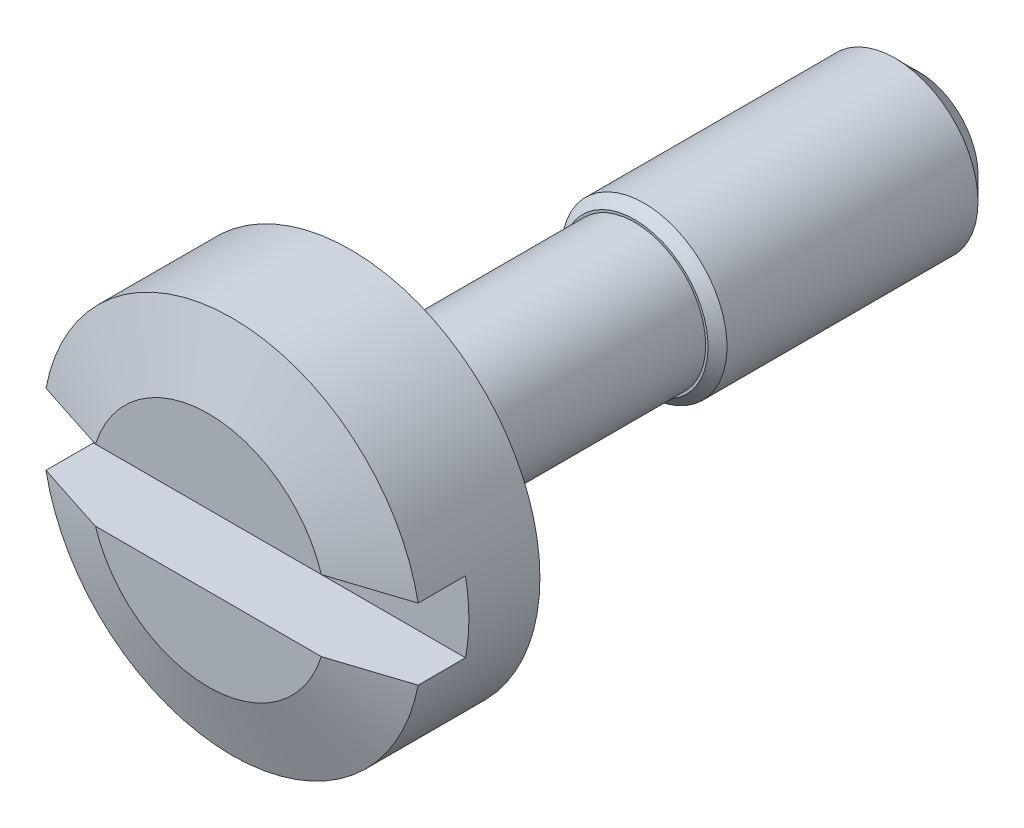
ISO-10303-21;
HEADER;
FILE_DESCRIPTION(('STEP AP214'),'2;1');
FILE_NAME('part.step','',(''),(''),'','','');
FILE_SCHEMA(('AUTOMOTIVE_DESIGN { 1 0 10303 214 1 1 1 1 }'));
ENDSEC;
DATA;
#1=APPLICATION_CONTEXT('core data for automotive mechanical design processes');
#2=APPLICATION_PROTOCOL_DEFINITION('international standard','automotive_design',2000,#1);
#3=PRODUCT_CONTEXT('',#1,'mechanical');
#4=PRODUCT('Part','Part','',(#3));
#5=PRODUCT_RELATED_PRODUCT_CATEGORY('part','',(#4));
#6=PRODUCT_DEFINITION_FORMATION('','',#4);
#7=PRODUCT_DEFINITION_CONTEXT('part definition',#1,'design');
#8=PRODUCT_DEFINITION('design','',#6,#7);
#9=PRODUCT_DEFINITION_SHAPE('','',#8);
#10=(LENGTH_UNIT() NAMED_UNIT(*) SI_UNIT(.MILLI.,.METRE.));
#11=(NAMED_UNIT(*) PLANE_ANGLE_UNIT() SI_UNIT($,.RADIAN.));
#12=(NAMED_UNIT(*) SI_UNIT($,.STERADIAN.) SOLID_ANGLE_UNIT());
#13=UNCERTAINTY_MEASURE_WITH_UNIT(LENGTH_MEASURE(1.E-05),#10,'distance_accuracy_value','');
#14=(GEOMETRIC_REPRESENTATION_CONTEXT(3) GLOBAL_UNCERTAINTY_ASSIGNED_CONTEXT((#13)) GLOBAL_UNIT_ASSIGNED_CONTEXT((#10,
#11,#12)) REPRESENTATION_CONTEXT('',''));
#15=CARTESIAN_POINT('',(0.,0.,0.));
#16=DIRECTION('',(0.,0.,1.));
#17=DIRECTION('',(1.,0.,0.));
#18=AXIS2_PLACEMENT_3D('',#15,#16,#17);
#19=CARTESIAN_POINT('',(0.,0.,-12.));
#20=DIRECTION('',(0.,0.,-1.));
#21=DIRECTION('',(-1.,0.,0.));
#22=AXIS2_PLACEMENT_3D('',#19,#20,#21);
#23=PLANE('',#22);
#24=CARTESIAN_POINT('',(0.,0.,-12.));
#25=DIRECTION('',(0.,0.,-1.));
#26=DIRECTION('',(-1.,0.,0.));
#27=AXIS2_PLACEMENT_3D('',#24,#25,#26);
#28=CIRCLE('',#27,1.24999406649664);
#29=CARTESIAN_POINT('',(-1.24999406649664,0.,-12.));
#30=VERTEX_POINT('',#29);
#31=EDGE_CURVE('E19',#30,#30,#28,.F.);
#32=ORIENTED_EDGE('',*,*,#31,.F.);
#33=EDGE_LOOP('',(#32));
#34=FACE_BOUND('',#33,.T.);
#35=ADVANCED_FACE('F16',(#34),#23,.T.);
#36=CARTESIAN_POINT('',(0.,0.,-11.4999953298707));
#37=DIRECTION('',(0.,0.,1.));
#38=DIRECTION('',(1.,0.,0.));
#39=AXIS2_PLACEMENT_3D('',#36,#37,#38);
#40=CONICAL_SURFACE('',#39,1.74999636323037,0.785395790018378);
#41=CARTESIAN_POINT('',(0.,0.,-11.4999916930838));
#42=DIRECTION('',(0.,0.,1.));
#43=DIRECTION('',(1.,0.,0.));
#44=AXIS2_PLACEMENT_3D('',#41,#42,#43);
#45=CIRCLE('',#44,1.75);
#46=CARTESIAN_POINT('',(1.75,0.,-11.4999916930838));
#47=VERTEX_POINT('',#46);
#48=EDGE_CURVE('E213',#47,#47,#45,.T.);
#49=ORIENTED_EDGE('',*,*,#48,.F.);
#50=EDGE_LOOP('',(#49));
#51=FACE_BOUND('',#50,.T.);
#52=ORIENTED_EDGE('',*,*,#31,.T.);
#53=EDGE_LOOP('',(#52));
#54=FACE_BOUND('',#53,.T.);
#55=ADVANCED_FACE('F164',(#51,#54),#40,.T.);
#56=CARTESIAN_POINT('',(0.,0.,1.5));
#57=DIRECTION('',(0.,0.,1.));
#58=DIRECTION('',(1.,0.,0.));
#59=AXIS2_PLACEMENT_3D('',#56,#57,#58);
#60=PLANE('',#59);
#61=DIRECTION('',(1.,0.,0.));
#62=VECTOR('',#61,1.);
#63=CARTESIAN_POINT('',(-3.929058411375,-0.75,1.5));
#64=LINE('',#63,#62);
#65=CARTESIAN_POINT('',(-3.92905841137521,-0.75,1.5));
#66=VERTEX_POINT('',#65);
#67=CARTESIAN_POINT('',(3.92905841137521,-0.75,1.5));
#68=VERTEX_POINT('',#67);
#69=EDGE_CURVE('E93',#66,#68,#64,.T.);
#70=ORIENTED_EDGE('',*,*,#69,.T.);
#71=CARTESIAN_POINT('',(0.,0.,1.5));
#72=DIRECTION('',(0.,0.,1.));
#73=DIRECTION('',(1.,0.,0.));
#74=AXIS2_PLACEMENT_3D('',#71,#72,#73);
#75=CIRCLE('',#74,4.);
#76=CARTESIAN_POINT('',(3.92905841137521,0.75,1.5));
#77=VERTEX_POINT('',#76);
#78=EDGE_CURVE('E76',#68,#77,#75,.T.);
#79=ORIENTED_EDGE('',*,*,#78,.T.);
#80=DIRECTION('',(1.,0.,0.));
#81=VECTOR('',#80,1.);
#82=CARTESIAN_POINT('',(3.929058411375,0.75,1.5));
#83=LINE('',#82,#81);
#84=CARTESIAN_POINT('',(-3.92905841137521,0.75,1.5));
#85=VERTEX_POINT('',#84);
#86=EDGE_CURVE('E80',#77,#85,#83,.F.);
#87=ORIENTED_EDGE('',*,*,#86,.T.);
#88=CARTESIAN_POINT('',(0.,0.,1.5));
#89=DIRECTION('',(0.,0.,1.));
#90=DIRECTION('',(1.,0.,0.));
#91=AXIS2_PLACEMENT_3D('',#88,#89,#90);
#92=CIRCLE('',#91,4.);
#93=EDGE_CURVE('E68',#85,#66,#92,.T.);
#94=ORIENTED_EDGE('',*,*,#93,.T.);
#95=EDGE_LOOP('',(#70,#79,#87,#94));
#96=FACE_BOUND('',#95,.T.);
#97=ADVANCED_FACE('F87',(#96),#60,.T.);
#98=CARTESIAN_POINT('',(0.,0.,-6.));
#99=DIRECTION('',(0.,0.,-1.));
#100=DIRECTION('',(-1.,0.,0.));
#101=AXIS2_PLACEMENT_3D('',#98,#99,#100);
#102=CYLINDRICAL_SURFACE('',#101,1.75);
#103=ORIENTED_EDGE('',*,*,#48,.T.);
#104=EDGE_LOOP('',(#103));
#105=FACE_BOUND('',#104,.T.);
#106=CARTESIAN_POINT('',(0.,0.,-6.20001215710185));
#107=DIRECTION('',(0.,0.,-1.));
#108=DIRECTION('',(-1.,0.,0.));
#109=AXIS2_PLACEMENT_3D('',#106,#107,#108);
#110=CIRCLE('',#109,1.75);
#111=CARTESIAN_POINT('',(-1.75,0.,-6.20001215710185));
#112=VERTEX_POINT('',#111);
#113=EDGE_CURVE('E206',#112,#112,#110,.F.);
#114=ORIENTED_EDGE('',*,*,#113,.F.);
#115=EDGE_LOOP('',(#114));
#116=FACE_BOUND('',#115,.T.);
#117=ADVANCED_FACE('F158',(#105,#116),#102,.T.);
#118=CARTESIAN_POINT('',(0.,0.,3.));
#119=DIRECTION('',(0.,0.,1.));
#120=DIRECTION('',(1.,0.,0.));
#121=AXIS2_PLACEMENT_3D('',#118,#119,#120);
#122=PLANE('',#121);
#123=CARTESIAN_POINT('',(0.,0.,2.9999999999859));
#124=DIRECTION('',(0.,0.,-1.));
#125=DIRECTION('',(-1.,0.,0.));
#126=AXIS2_PLACEMENT_3D('',#123,#124,#125);
#127=CIRCLE('',#126,2.50000011760676);
#128=CARTESIAN_POINT('',(-2.38484812680558,0.75,2.99999999999295));
#129=VERTEX_POINT('',#128);
#130=CARTESIAN_POINT('',(2.38484812680558,0.75,2.99999999999295));
#131=VERTEX_POINT('',#130);
#132=EDGE_CURVE('E208',#129,#131,#127,.T.);
#133=ORIENTED_EDGE('',*,*,#132,.F.);
#134=DIRECTION('',(1.,0.,0.));
#135=VECTOR('',#134,1.);
#136=CARTESIAN_POINT('',(3.929058411375,0.75,3.));
#137=LINE('',#136,#135);
#138=EDGE_CURVE('E90',#129,#131,#137,.T.);
#139=ORIENTED_EDGE('',*,*,#138,.T.);
#140=EDGE_LOOP('',(#133,#139));
#141=FACE_BOUND('',#140,.T.);
#142=ADVANCED_FACE('F154',(#141),#122,.T.);
#143=CARTESIAN_POINT('',(3.929058411375,0.75,3.));
#144=DIRECTION('',(0.,1.,0.));
#145=DIRECTION('',(0.,0.,1.));
#146=AXIS2_PLACEMENT_3D('',#143,#144,#145);
#147=PLANE('',#146);
#148=DIRECTION('',(0.,0.,1.));
#149=VECTOR('',#148,1.);
#150=CARTESIAN_POINT('',(-3.929058411375,0.75,3.));
#151=LINE('',#150,#149);
#152=CARTESIAN_POINT('',(-3.929058411375,0.75,2.50000006268605));
#153=VERTEX_POINT('',#152);
#154=EDGE_CURVE('E73',#85,#153,#151,.T.);
#155=ORIENTED_EDGE('',*,*,#154,.F.);
#156=ORIENTED_EDGE('',*,*,#86,.F.);
#157=DIRECTION('',(0.,0.,1.));
#158=VECTOR('',#157,1.);
#159=CARTESIAN_POINT('',(3.929058411375,0.75,3.));
#160=LINE('',#159,#158);
#161=CARTESIAN_POINT('',(3.929058411375,0.75,2.50000006268605));
#162=VERTEX_POINT('',#161);
#163=EDGE_CURVE('E88',#162,#77,#160,.F.);
#164=ORIENTED_EDGE('',*,*,#163,.F.);
#165=CARTESIAN_POINT('',(2.38484812679657,0.75,2.99999999999582));
#166=CARTESIAN_POINT('',(2.51374687511697,0.75,2.95899823738204));
#167=CARTESIAN_POINT('',(2.64256768103771,0.75,2.91775286142067));
#168=CARTESIAN_POINT('',(2.90009194379183,0.75,2.83489904226949));
#169=CARTESIAN_POINT('',(3.02879540112082,0.75,2.79329060062098));
#170=CARTESIAN_POINT('',(3.28612426157192,0.75,2.70983456783993));
#171=CARTESIAN_POINT('',(3.41474966489581,0.75,2.66798697732857));
#172=CARTESIAN_POINT('',(3.6719426732032,0.75,2.58411270811083));
#173=CARTESIAN_POINT('',(3.80051027794505,0.75,2.54208602866326));
#174=CARTESIAN_POINT('',(3.9290584113746,0.75,2.50000006267423));
#175=B_SPLINE_CURVE_WITH_KNOTS('',3,(#165,#166,#167,#168,#169,#170,#171,#172,#173,#174),
.UNSPECIFIED.,.F.,.F.,(4,2,2,2,4),(0.,0.405787624750844,0.81157352768695,1.21735837711979,
1.62314490758791),.UNSPECIFIED.);
#176=EDGE_CURVE('E139',#131,#162,#175,.T.);
#177=ORIENTED_EDGE('',*,*,#176,.F.);
#178=ORIENTED_EDGE('',*,*,#138,.F.);
#179=CARTESIAN_POINT('',(-3.9290584113746,0.75,2.50000006267423));
#180=CARTESIAN_POINT('',(-3.80051027794505,0.75,2.54208602866326));
#181=CARTESIAN_POINT('',(-3.6719426732032,0.75,2.58411270811083));
#182=CARTESIAN_POINT('',(-3.41474966489581,0.75,2.66798697732857));
#183=CARTESIAN_POINT('',(-3.28612426157192,0.75,2.70983456783994));
#184=CARTESIAN_POINT('',(-3.02879540112082,0.75,2.79329060062098));
#185=CARTESIAN_POINT('',(-2.90009194379183,0.75,2.83489904226949));
#186=CARTESIAN_POINT('',(-2.64256768103771,0.75,2.91775286142066));
#187=CARTESIAN_POINT('',(-2.51374687511697,0.75,2.95899823738204));
#188=CARTESIAN_POINT('',(-2.38484812679657,0.75,2.99999999999582));
#189=B_SPLINE_CURVE_WITH_KNOTS('',3,(#179,#180,#181,#182,#183,#184,#185,#186,#187,#188),
.UNSPECIFIED.,.F.,.F.,(4,2,2,2,4),(0.,0.405786530468124,0.811571379900961,1.21735728283707,
1.62314490758791),.UNSPECIFIED.);
#190=EDGE_CURVE('E83',#153,#129,#189,.T.);
#191=ORIENTED_EDGE('',*,*,#190,.F.);
#192=EDGE_LOOP('',(#155,#156,#164,#177,#178,#191));
#193=FACE_BOUND('',#192,.T.);
#194=ADVANCED_FACE('F79',(#193),#147,.F.);
#195=CARTESIAN_POINT('',(0.,0.,3.));
#196=DIRECTION('',(0.,0.,1.));
#197=DIRECTION('',(1.,0.,0.));
#198=AXIS2_PLACEMENT_3D('',#195,#196,#197);
#199=PLANE('',#198);
#200=CARTESIAN_POINT('',(0.,0.,2.9999999999859));
#201=DIRECTION('',(0.,0.,-1.));
#202=DIRECTION('',(-1.,0.,0.));
#203=AXIS2_PLACEMENT_3D('',#200,#201,#202);
#204=CIRCLE('',#203,2.50000011760676);
#205=CARTESIAN_POINT('',(2.38484812680558,-0.75,2.99999999999295));
#206=VERTEX_POINT('',#205);
#207=CARTESIAN_POINT('',(-2.38484812680558,-0.75,2.99999999999295));
#208=VERTEX_POINT('',#207);
#209=EDGE_CURVE('E149',#206,#208,#204,.T.);
#210=ORIENTED_EDGE('',*,*,#209,.F.);
#211=DIRECTION('',(1.,0.,0.));
#212=VECTOR('',#211,1.);
#213=CARTESIAN_POINT('',(-3.929058411375,-0.75,3.));
#214=LINE('',#213,#212);
#215=EDGE_CURVE('E85',#206,#208,#214,.F.);
#216=ORIENTED_EDGE('',*,*,#215,.T.);
#217=EDGE_LOOP('',(#210,#216));
#218=FACE_BOUND('',#217,.T.);
#219=ADVANCED_FACE('F153',(#218),#199,.T.);
#220=CARTESIAN_POINT('',(-3.929058411375,-0.75,3.));
#221=DIRECTION('',(0.,-1.,0.));
#222=DIRECTION('',(0.,0.,-1.));
#223=AXIS2_PLACEMENT_3D('',#220,#221,#222);
#224=PLANE('',#223);
#225=DIRECTION('',(0.,0.,-1.));
#226=VECTOR('',#225,1.);
#227=CARTESIAN_POINT('',(3.929058411375,-0.75,3.));
#228=LINE('',#227,#226);
#229=CARTESIAN_POINT('',(3.929058411375,-0.75,2.50000006268605));
#230=VERTEX_POINT('',#229);
#231=EDGE_CURVE('E209',#68,#230,#228,.F.);
#232=ORIENTED_EDGE('',*,*,#231,.F.);
#233=ORIENTED_EDGE('',*,*,#69,.F.);
#234=DIRECTION('',(0.,0.,-1.));
#235=VECTOR('',#234,1.);
#236=CARTESIAN_POINT('',(-3.929058411375,-0.75,3.));
#237=LINE('',#236,#235);
#238=CARTESIAN_POINT('',(-3.929058411375,-0.75,2.50000006268605));
#239=VERTEX_POINT('',#238);
#240=EDGE_CURVE('E34',#239,#66,#237,.T.);
#241=ORIENTED_EDGE('',*,*,#240,.F.);
#242=CARTESIAN_POINT('',(-2.38484812679657,-0.75,2.99999999999582));
#243=CARTESIAN_POINT('',(-2.51374687511697,-0.75,2.95899823738204));
#244=CARTESIAN_POINT('',(-2.64256768103771,-0.75,2.91775286142067));
#245=CARTESIAN_POINT('',(-2.90009194379183,-0.75,2.83489904226949));
#246=CARTESIAN_POINT('',(-3.02879540112082,-0.75,2.79329060062098));
#247=CARTESIAN_POINT('',(-3.28612426157192,-0.75,2.70983456783993));
#248=CARTESIAN_POINT('',(-3.41474966489581,-0.75,2.66798697732857));
#249=CARTESIAN_POINT('',(-3.6719426732032,-0.75,2.58411270811083));
#250=CARTESIAN_POINT('',(-3.80051027794505,-0.75,2.54208602866326));
#251=CARTESIAN_POINT('',(-3.9290584113746,-0.75,2.50000006267423));
#252=B_SPLINE_CURVE_WITH_KNOTS('',3,(#242,#243,#244,#245,#246,#247,#248,#249,#250,#251),
.UNSPECIFIED.,.F.,.F.,(4,2,2,2,4),(0.,0.405787624750844,0.81157352768695,1.21735837711979,
1.62314490758791),.UNSPECIFIED.);
#253=EDGE_CURVE('E114',#208,#239,#252,.T.);
#254=ORIENTED_EDGE('',*,*,#253,.F.);
#255=ORIENTED_EDGE('',*,*,#215,.F.);
#256=CARTESIAN_POINT('',(3.9290584113746,-0.75,2.50000006267423));
#257=CARTESIAN_POINT('',(3.80051027794505,-0.75,2.54208602866326));
#258=CARTESIAN_POINT('',(3.6719426732032,-0.75,2.58411270811083));
#259=CARTESIAN_POINT('',(3.41474966489581,-0.75,2.66798697732857));
#260=CARTESIAN_POINT('',(3.28612426157192,-0.75,2.70983456783994));
#261=CARTESIAN_POINT('',(3.02879540112082,-0.75,2.79329060062098));
#262=CARTESIAN_POINT('',(2.90009194379183,-0.75,2.83489904226949));
#263=CARTESIAN_POINT('',(2.64256768103771,-0.75,2.91775286142066));
#264=CARTESIAN_POINT('',(2.51374687511697,-0.75,2.95899823738204));
#265=CARTESIAN_POINT('',(2.38484812679657,-0.75,2.99999999999582));
#266=B_SPLINE_CURVE_WITH_KNOTS('',3,(#256,#257,#258,#259,#260,#261,#262,#263,#264,#265),
.UNSPECIFIED.,.F.,.F.,(4,2,2,2,4),(0.,0.405786530468124,0.811571379900961,1.21735728283707,
1.62314490758791),.UNSPECIFIED.);
#267=EDGE_CURVE('E106',#230,#206,#266,.T.);
#268=ORIENTED_EDGE('',*,*,#267,.F.);
#269=EDGE_LOOP('',(#232,#233,#241,#254,#255,#268));
#270=FACE_BOUND('',#269,.T.);
#271=ADVANCED_FACE('F119',(#270),#224,.F.);
#272=CARTESIAN_POINT('',(0.,0.,-6.20000684847355));
#273=DIRECTION('',(0.,0.,-1.));
#274=DIRECTION('',(-1.,0.,0.));
#275=AXIS2_PLACEMENT_3D('',#272,#273,#274);
#276=CONICAL_SURFACE('',#275,1.74999469140857,0.785394690005506);
#277=ORIENTED_EDGE('',*,*,#113,.T.);
#278=EDGE_LOOP('',(#277));
#279=FACE_BOUND('',#278,.T.);
#280=CARTESIAN_POINT('',(0.,0.,-6.));
#281=DIRECTION('',(0.,0.,-1.));
#282=DIRECTION('',(-1.,0.,0.));
#283=AXIS2_PLACEMENT_3D('',#280,#281,#282);
#284=CIRCLE('',#283,1.54998923233455);
#285=CARTESIAN_POINT('',(-1.54998923233455,0.,-6.));
#286=VERTEX_POINT('',#285);
#287=EDGE_CURVE('E102',#286,#286,#284,.T.);
#288=ORIENTED_EDGE('',*,*,#287,.T.);
#289=EDGE_LOOP('',(#288));
#290=FACE_BOUND('',#289,.T.);
#291=ADVANCED_FACE('F135',(#279,#290),#276,.T.);
#292=CARTESIAN_POINT('',(0.,0.,2.5000000626676));
#293=DIRECTION('',(0.,0.,-1.));
#294=DIRECTION('',(-1.,0.,0.));
#295=AXIS2_PLACEMENT_3D('',#292,#293,#294);
#296=CONICAL_SURFACE('',#295,4.0000000000191,1.24904578648974);
#297=CARTESIAN_POINT('',(0.,0.,2.500000062698));
#298=DIRECTION('',(0.,0.,1.));
#299=DIRECTION('',(1.,0.,0.));
#300=AXIS2_PLACEMENT_3D('',#297,#298,#299);
#301=CIRCLE('',#300,4.);
#302=EDGE_CURVE('E105',#153,#162,#301,.F.);
#303=ORIENTED_EDGE('',*,*,#302,.F.);
#304=ORIENTED_EDGE('',*,*,#190,.T.);
#305=ORIENTED_EDGE('',*,*,#132,.T.);
#306=ORIENTED_EDGE('',*,*,#176,.T.);
#307=EDGE_LOOP('',(#303,#304,#305,#306));
#308=FACE_BOUND('',#307,.T.);
#309=ADVANCED_FACE('F129',(#308),#296,.T.);
#310=CARTESIAN_POINT('',(0.,0.,2.5000000626676));
#311=DIRECTION('',(0.,0.,-1.));
#312=DIRECTION('',(-1.,0.,0.));
#313=AXIS2_PLACEMENT_3D('',#310,#311,#312);
#314=CONICAL_SURFACE('',#313,4.0000000000191,1.24904578648974);
#315=CARTESIAN_POINT('',(0.,0.,2.500000062698));
#316=DIRECTION('',(0.,0.,1.));
#317=DIRECTION('',(1.,0.,0.));
#318=AXIS2_PLACEMENT_3D('',#315,#316,#317);
#319=CIRCLE('',#318,4.);
#320=EDGE_CURVE('E101',#230,#239,#319,.F.);
#321=ORIENTED_EDGE('',*,*,#320,.F.);
#322=ORIENTED_EDGE('',*,*,#267,.T.);
#323=ORIENTED_EDGE('',*,*,#209,.T.);
#324=ORIENTED_EDGE('',*,*,#253,.T.);
#325=EDGE_LOOP('',(#321,#322,#323,#324));
#326=FACE_BOUND('',#325,.T.);
#327=ADVANCED_FACE('F123',(#326),#314,.T.);
#328=CARTESIAN_POINT('',(0.,0.,-6.));
#329=DIRECTION('',(0.,0.,-1.));
#330=DIRECTION('',(-1.,0.,0.));
#331=AXIS2_PLACEMENT_3D('',#328,#329,#330);
#332=PLANE('',#331);
#333=CARTESIAN_POINT('',(0.,0.,-6.));
#334=DIRECTION('',(0.,0.,1.));
#335=DIRECTION('',(1.,0.,0.));
#336=AXIS2_PLACEMENT_3D('',#333,#334,#335);
#337=CIRCLE('',#336,1.5);
#338=CARTESIAN_POINT('',(1.5,0.,-6.));
#339=VERTEX_POINT('',#338);
#340=EDGE_CURVE('E98',#339,#339,#337,.T.);
#341=ORIENTED_EDGE('',*,*,#340,.F.);
#342=EDGE_LOOP('',(#341));
#343=FACE_BOUND('',#342,.T.);
#344=ORIENTED_EDGE('',*,*,#287,.F.);
#345=EDGE_LOOP('',(#344));
#346=FACE_BOUND('',#345,.T.);
#347=ADVANCED_FACE('F128',(#343,#346),#332,.F.);
#348=CARTESIAN_POINT('',(0.,0.,0.));
#349=DIRECTION('',(0.,0.,1.));
#350=DIRECTION('',(1.,0.,0.));
#351=AXIS2_PLACEMENT_3D('',#348,#349,#350);
#352=CYLINDRICAL_SURFACE('',#351,4.);
#353=CARTESIAN_POINT('',(0.,0.,0.));
#354=DIRECTION('',(0.,0.,1.));
#355=DIRECTION('',(1.,0.,0.));
#356=AXIS2_PLACEMENT_3D('',#353,#354,#355);
#357=CIRCLE('',#356,4.);
#358=CARTESIAN_POINT('',(4.,0.,0.));
#359=VERTEX_POINT('',#358);
#360=EDGE_CURVE('E25',#359,#359,#357,.T.);
#361=ORIENTED_EDGE('',*,*,#360,.T.);
#362=EDGE_LOOP('',(#361));
#363=FACE_BOUND('',#362,.T.);
#364=ORIENTED_EDGE('',*,*,#240,.T.);
#365=ORIENTED_EDGE('',*,*,#93,.F.);
#366=ORIENTED_EDGE('',*,*,#154,.T.);
#367=ORIENTED_EDGE('',*,*,#302,.T.);
#368=ORIENTED_EDGE('',*,*,#163,.T.);
#369=ORIENTED_EDGE('',*,*,#78,.F.);
#370=ORIENTED_EDGE('',*,*,#231,.T.);
#371=ORIENTED_EDGE('',*,*,#320,.T.);
#372=EDGE_LOOP('',(#364,#365,#366,#367,#368,#369,#370,#371));
#373=FACE_BOUND('',#372,.T.);
#374=ADVANCED_FACE('F71',(#363,#373),#352,.T.);
#375=CARTESIAN_POINT('',(0.,0.,0.));
#376=DIRECTION('',(0.,0.,1.));
#377=DIRECTION('',(1.,0.,0.));
#378=AXIS2_PLACEMENT_3D('',#375,#376,#377);
#379=CYLINDRICAL_SURFACE('',#378,1.5);
#380=CARTESIAN_POINT('',(0.,0.,0.));
#381=DIRECTION('',(0.,0.,1.));
#382=DIRECTION('',(1.,0.,0.));
#383=AXIS2_PLACEMENT_3D('',#380,#381,#382);
#384=CIRCLE('',#383,1.5);
#385=CARTESIAN_POINT('',(1.5,0.,0.));
#386=VERTEX_POINT('',#385);
#387=EDGE_CURVE('E11',#386,#386,#384,.F.);
#388=ORIENTED_EDGE('',*,*,#387,.T.);
#389=EDGE_LOOP('',(#388));
#390=FACE_BOUND('',#389,.T.);
#391=ORIENTED_EDGE('',*,*,#340,.T.);
#392=EDGE_LOOP('',(#391));
#393=FACE_BOUND('',#392,.T.);
#394=ADVANCED_FACE('F176',(#390,#393),#379,.T.);
#395=CARTESIAN_POINT('',(0.,0.,0.));
#396=DIRECTION('',(0.,0.,1.));
#397=DIRECTION('',(1.,0.,0.));
#398=AXIS2_PLACEMENT_3D('',#395,#396,#397);
#399=PLANE('',#398);
#400=ORIENTED_EDGE('',*,*,#387,.F.);
#401=EDGE_LOOP('',(#400));
#402=FACE_BOUND('',#401,.T.);
#403=ORIENTED_EDGE('',*,*,#360,.F.);
#404=EDGE_LOOP('',(#403));
#405=FACE_BOUND('',#404,.T.);
#406=ADVANCED_FACE('F174',(#402,#405),#399,.F.);
#407=CLOSED_SHELL('',(#35,#55,#97,#117,#142,#194,#219,#271,#291,#309,#327,#347,#374,#394,#406));
#408=MANIFOLD_SOLID_BREP('B1',#407);
#409=ADVANCED_BREP_SHAPE_REPRESENTATION('',(#18,#408),#14);
#410=SHAPE_DEFINITION_REPRESENTATION(#9,#409);
ENDSEC;
END-ISO-10303-21;
